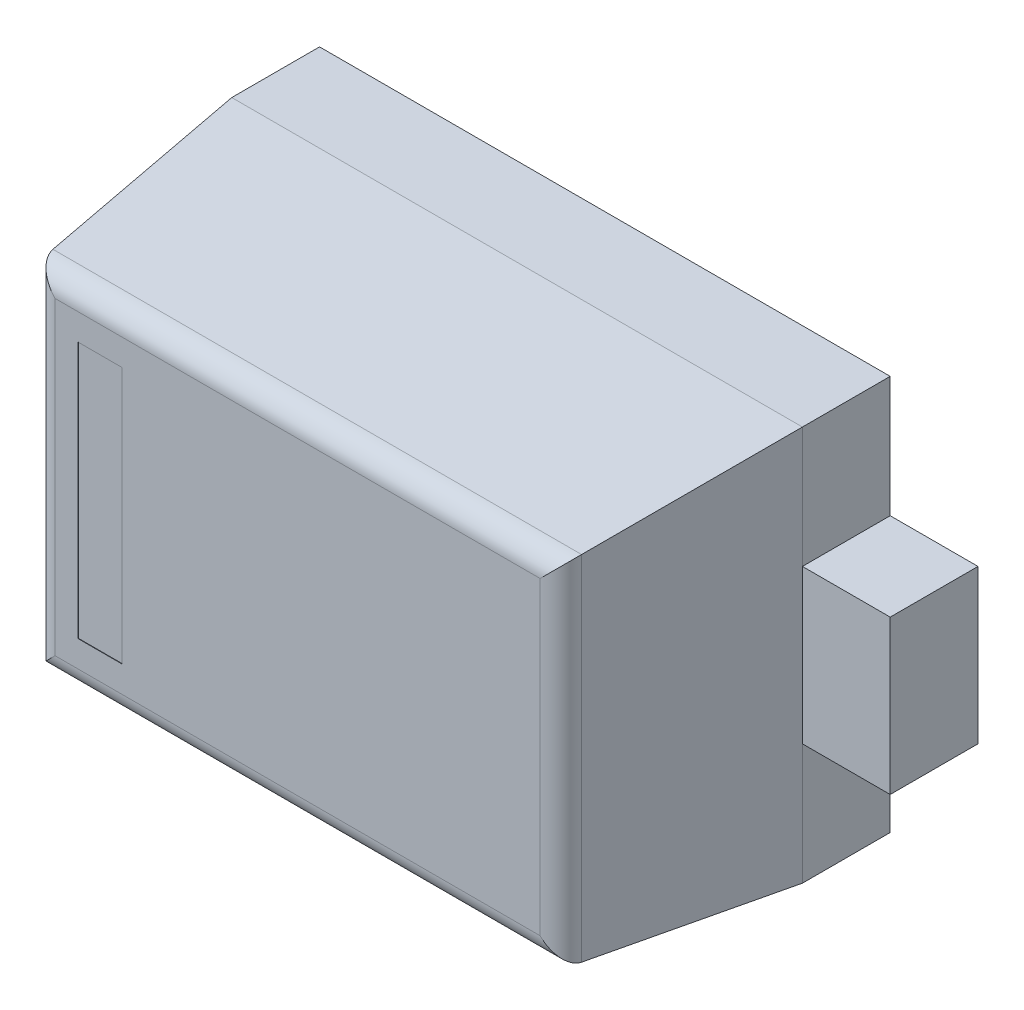
ISO-10303-21;
HEADER;
FILE_DESCRIPTION(('STEP AP214'),'2;1');
FILE_NAME('part.step','',(''),(''),'','','');
FILE_SCHEMA(('AUTOMOTIVE_DESIGN { 1 0 10303 214 1 1 1 1 }'));
ENDSEC;
DATA;
#1=APPLICATION_CONTEXT('core data for automotive mechanical design processes');
#2=APPLICATION_PROTOCOL_DEFINITION('international standard','automotive_design',2000,#1);
#3=PRODUCT_CONTEXT('',#1,'mechanical');
#4=PRODUCT('Part','Part','',(#3));
#5=PRODUCT_RELATED_PRODUCT_CATEGORY('part','',(#4));
#6=PRODUCT_DEFINITION_FORMATION('','',#4);
#7=PRODUCT_DEFINITION_CONTEXT('part definition',#1,'design');
#8=PRODUCT_DEFINITION('design','',#6,#7);
#9=PRODUCT_DEFINITION_SHAPE('','',#8);
#10=(LENGTH_UNIT() NAMED_UNIT(*) SI_UNIT(.MILLI.,.METRE.));
#11=(NAMED_UNIT(*) PLANE_ANGLE_UNIT() SI_UNIT($,.RADIAN.));
#12=(NAMED_UNIT(*) SI_UNIT($,.STERADIAN.) SOLID_ANGLE_UNIT());
#13=UNCERTAINTY_MEASURE_WITH_UNIT(LENGTH_MEASURE(1.E-05),#10,'distance_accuracy_value','');
#14=(GEOMETRIC_REPRESENTATION_CONTEXT(3) GLOBAL_UNCERTAINTY_ASSIGNED_CONTEXT((#13)) GLOBAL_UNIT_ASSIGNED_CONTEXT((#10,
#11,#12)) REPRESENTATION_CONTEXT('',''));
#15=CARTESIAN_POINT('',(0.,0.,0.));
#16=DIRECTION('',(0.,0.,1.));
#17=DIRECTION('',(1.,0.,0.));
#18=AXIS2_PLACEMENT_3D('',#15,#16,#17);
#19=CARTESIAN_POINT('',(0.,0.,0.2));
#20=DIRECTION('',(0.,0.,-1.));
#21=DIRECTION('',(0.,-1.,0.));
#22=AXIS2_PLACEMENT_3D('',#19,#20,#21);
#23=PLANE('',#22);
#24=DIRECTION('',(0.,-1.,0.));
#25=VECTOR('',#24,1.);
#26=CARTESIAN_POINT('',(-0.85,0.175,0.2));
#27=LINE('',#26,#25);
#28=CARTESIAN_POINT('',(-0.85,0.175,0.2));
#29=VERTEX_POINT('',#28);
#30=CARTESIAN_POINT('',(-0.85,-0.175,0.2));
#31=VERTEX_POINT('',#30);
#32=EDGE_CURVE('E253',#29,#31,#27,.T.);
#33=ORIENTED_EDGE('',*,*,#32,.T.);
#34=DIRECTION('',(1.,0.,0.));
#35=VECTOR('',#34,1.);
#36=CARTESIAN_POINT('',(-0.65,-0.175,0.2));
#37=LINE('',#36,#35);
#38=CARTESIAN_POINT('',(-0.65,-0.175,0.2));
#39=VERTEX_POINT('',#38);
#40=EDGE_CURVE('E25',#31,#39,#37,.T.);
#41=ORIENTED_EDGE('',*,*,#40,.T.);
#42=DIRECTION('',(0.,1.,0.));
#43=VECTOR('',#42,1.);
#44=CARTESIAN_POINT('',(-0.65,0.175,0.2));
#45=LINE('',#44,#43);
#46=CARTESIAN_POINT('',(-0.65,0.175,0.2));
#47=VERTEX_POINT('',#46);
#48=EDGE_CURVE('E372',#39,#47,#45,.T.);
#49=ORIENTED_EDGE('',*,*,#48,.T.);
#50=DIRECTION('',(-1.,0.,0.));
#51=VECTOR('',#50,1.);
#52=CARTESIAN_POINT('',(-0.65,0.175,0.2));
#53=LINE('',#52,#51);
#54=EDGE_CURVE('E11',#47,#29,#53,.T.);
#55=ORIENTED_EDGE('',*,*,#54,.T.);
#56=EDGE_LOOP('',(#33,#41,#49,#55));
#57=FACE_BOUND('',#56,.T.);
#58=ADVANCED_FACE('F17',(#57),#23,.F.);
#59=CARTESIAN_POINT('',(-0.65,0.175,0.2));
#60=DIRECTION('',(0.,-1.,0.));
#61=DIRECTION('',(0.,0.,-1.));
#62=AXIS2_PLACEMENT_3D('',#59,#60,#61);
#63=PLANE('',#62);
#64=DIRECTION('',(-1.,0.,0.));
#65=VECTOR('',#64,1.);
#66=CARTESIAN_POINT('',(-0.65,0.175,0.));
#67=LINE('',#66,#65);
#68=CARTESIAN_POINT('',(-0.65,0.175,0.));
#69=VERTEX_POINT('',#68);
#70=CARTESIAN_POINT('',(-0.85,0.175,0.));
#71=VERTEX_POINT('',#70);
#72=EDGE_CURVE('E330',#69,#71,#67,.T.);
#73=ORIENTED_EDGE('',*,*,#72,.T.);
#74=DIRECTION('',(0.,0.,-1.));
#75=VECTOR('',#74,1.);
#76=CARTESIAN_POINT('',(-0.85,0.175,0.2));
#77=LINE('',#76,#75);
#78=EDGE_CURVE('E295',#29,#71,#77,.T.);
#79=ORIENTED_EDGE('',*,*,#78,.F.);
#80=ORIENTED_EDGE('',*,*,#54,.F.);
#81=DIRECTION('',(0.,0.,-1.));
#82=VECTOR('',#81,1.);
#83=CARTESIAN_POINT('',(-0.65,0.175,0.2));
#84=LINE('',#83,#82);
#85=EDGE_CURVE('E457',#47,#69,#84,.T.);
#86=ORIENTED_EDGE('',*,*,#85,.T.);
#87=EDGE_LOOP('',(#73,#79,#80,#86));
#88=FACE_BOUND('',#87,.T.);
#89=ADVANCED_FACE('F455',(#88),#63,.F.);
#90=CARTESIAN_POINT('',(-0.65,-0.175,0.2));
#91=DIRECTION('',(0.,1.,0.));
#92=DIRECTION('',(1.,0.,0.));
#93=AXIS2_PLACEMENT_3D('',#90,#91,#92);
#94=PLANE('',#93);
#95=DIRECTION('',(1.,0.,0.));
#96=VECTOR('',#95,1.);
#97=CARTESIAN_POINT('',(-0.65,-0.175,0.));
#98=LINE('',#97,#96);
#99=CARTESIAN_POINT('',(-0.85,-0.175,0.));
#100=VERTEX_POINT('',#99);
#101=CARTESIAN_POINT('',(-0.65,-0.175,0.));
#102=VERTEX_POINT('',#101);
#103=EDGE_CURVE('E316',#100,#102,#98,.T.);
#104=ORIENTED_EDGE('',*,*,#103,.T.);
#105=DIRECTION('',(0.,0.,-1.));
#106=VECTOR('',#105,1.);
#107=CARTESIAN_POINT('',(-0.65,-0.175,0.2));
#108=LINE('',#107,#106);
#109=EDGE_CURVE('E264',#39,#102,#108,.T.);
#110=ORIENTED_EDGE('',*,*,#109,.F.);
#111=ORIENTED_EDGE('',*,*,#40,.F.);
#112=DIRECTION('',(0.,0.,-1.));
#113=VECTOR('',#112,1.);
#114=CARTESIAN_POINT('',(-0.85,-0.175,0.2));
#115=LINE('',#114,#113);
#116=EDGE_CURVE('E250',#31,#100,#115,.T.);
#117=ORIENTED_EDGE('',*,*,#116,.T.);
#118=EDGE_LOOP('',(#104,#110,#111,#117));
#119=FACE_BOUND('',#118,.T.);
#120=ADVANCED_FACE('F460',(#119),#94,.F.);
#121=CARTESIAN_POINT('',(-0.85,0.175,0.2));
#122=DIRECTION('',(1.,0.,0.));
#123=DIRECTION('',(0.,1.,0.));
#124=AXIS2_PLACEMENT_3D('',#121,#122,#123);
#125=PLANE('',#124);
#126=DIRECTION('',(0.,-1.,0.));
#127=VECTOR('',#126,1.);
#128=CARTESIAN_POINT('',(-0.85,0.175,0.));
#129=LINE('',#128,#127);
#130=EDGE_CURVE('E326',#71,#100,#129,.T.);
#131=ORIENTED_EDGE('',*,*,#130,.T.);
#132=ORIENTED_EDGE('',*,*,#116,.F.);
#133=ORIENTED_EDGE('',*,*,#32,.F.);
#134=ORIENTED_EDGE('',*,*,#78,.T.);
#135=EDGE_LOOP('',(#131,#132,#133,#134));
#136=FACE_BOUND('',#135,.T.);
#137=ADVANCED_FACE('F449',(#136),#125,.F.);
#138=CARTESIAN_POINT('',(0.,0.,0.2));
#139=DIRECTION('',(0.,0.,-1.));
#140=DIRECTION('',(0.,-1.,0.));
#141=AXIS2_PLACEMENT_3D('',#138,#139,#140);
#142=PLANE('',#141);
#143=DIRECTION('',(0.,1.,0.));
#144=VECTOR('',#143,1.);
#145=CARTESIAN_POINT('',(0.85,-0.175,0.2));
#146=LINE('',#145,#144);
#147=CARTESIAN_POINT('',(0.85,-0.175,0.2));
#148=VERTEX_POINT('',#147);
#149=CARTESIAN_POINT('',(0.85,0.175,0.2));
#150=VERTEX_POINT('',#149);
#151=EDGE_CURVE('E436',#148,#150,#146,.T.);
#152=ORIENTED_EDGE('',*,*,#151,.T.);
#153=DIRECTION('',(-1.,0.,0.));
#154=VECTOR('',#153,1.);
#155=CARTESIAN_POINT('',(0.65,0.175,0.2));
#156=LINE('',#155,#154);
#157=CARTESIAN_POINT('',(0.65,0.175,0.2));
#158=VERTEX_POINT('',#157);
#159=EDGE_CURVE('E333',#150,#158,#156,.T.);
#160=ORIENTED_EDGE('',*,*,#159,.T.);
#161=DIRECTION('',(0.,-1.,0.));
#162=VECTOR('',#161,1.);
#163=CARTESIAN_POINT('',(0.65,-0.175,0.2));
#164=LINE('',#163,#162);
#165=CARTESIAN_POINT('',(0.65,-0.175,0.2));
#166=VERTEX_POINT('',#165);
#167=EDGE_CURVE('E355',#158,#166,#164,.T.);
#168=ORIENTED_EDGE('',*,*,#167,.T.);
#169=DIRECTION('',(1.,0.,0.));
#170=VECTOR('',#169,1.);
#171=CARTESIAN_POINT('',(0.65,-0.175,0.2));
#172=LINE('',#171,#170);
#173=EDGE_CURVE('E226',#166,#148,#172,.T.);
#174=ORIENTED_EDGE('',*,*,#173,.T.);
#175=EDGE_LOOP('',(#152,#160,#168,#174));
#176=FACE_BOUND('',#175,.T.);
#177=ADVANCED_FACE('F518',(#176),#142,.F.);
#178=CARTESIAN_POINT('',(0.65,-0.175,0.2));
#179=DIRECTION('',(0.,1.,0.));
#180=DIRECTION('',(1.,0.,0.));
#181=AXIS2_PLACEMENT_3D('',#178,#179,#180);
#182=PLANE('',#181);
#183=DIRECTION('',(1.,0.,0.));
#184=VECTOR('',#183,1.);
#185=CARTESIAN_POINT('',(0.65,-0.175,0.));
#186=LINE('',#185,#184);
#187=CARTESIAN_POINT('',(0.65,-0.175,0.));
#188=VERTEX_POINT('',#187);
#189=CARTESIAN_POINT('',(0.85,-0.175,0.));
#190=VERTEX_POINT('',#189);
#191=EDGE_CURVE('E201',#188,#190,#186,.T.);
#192=ORIENTED_EDGE('',*,*,#191,.T.);
#193=DIRECTION('',(0.,0.,-1.));
#194=VECTOR('',#193,1.);
#195=CARTESIAN_POINT('',(0.85,-0.175,0.2));
#196=LINE('',#195,#194);
#197=EDGE_CURVE('E440',#148,#190,#196,.T.);
#198=ORIENTED_EDGE('',*,*,#197,.F.);
#199=ORIENTED_EDGE('',*,*,#173,.F.);
#200=DIRECTION('',(0.,0.,-1.));
#201=VECTOR('',#200,1.);
#202=CARTESIAN_POINT('',(0.65,-0.175,0.2));
#203=LINE('',#202,#201);
#204=EDGE_CURVE('E219',#166,#188,#203,.T.);
#205=ORIENTED_EDGE('',*,*,#204,.T.);
#206=EDGE_LOOP('',(#192,#198,#199,#205));
#207=FACE_BOUND('',#206,.T.);
#208=ADVANCED_FACE('F225',(#207),#182,.F.);
#209=CARTESIAN_POINT('',(0.65,0.175,0.2));
#210=DIRECTION('',(0.,-1.,0.));
#211=DIRECTION('',(-1.,0.,0.));
#212=AXIS2_PLACEMENT_3D('',#209,#210,#211);
#213=PLANE('',#212);
#214=DIRECTION('',(-1.,0.,0.));
#215=VECTOR('',#214,1.);
#216=CARTESIAN_POINT('',(0.65,0.175,0.));
#217=LINE('',#216,#215);
#218=CARTESIAN_POINT('',(0.85,0.175,0.));
#219=VERTEX_POINT('',#218);
#220=CARTESIAN_POINT('',(0.65,0.175,0.));
#221=VERTEX_POINT('',#220);
#222=EDGE_CURVE('E337',#219,#221,#217,.T.);
#223=ORIENTED_EDGE('',*,*,#222,.T.);
#224=DIRECTION('',(0.,0.,-1.));
#225=VECTOR('',#224,1.);
#226=CARTESIAN_POINT('',(0.65,0.175,0.2));
#227=LINE('',#226,#225);
#228=EDGE_CURVE('E256',#158,#221,#227,.T.);
#229=ORIENTED_EDGE('',*,*,#228,.F.);
#230=ORIENTED_EDGE('',*,*,#159,.F.);
#231=DIRECTION('',(0.,0.,-1.));
#232=VECTOR('',#231,1.);
#233=CARTESIAN_POINT('',(0.85,0.175,0.2));
#234=LINE('',#233,#232);
#235=EDGE_CURVE('E428',#150,#219,#234,.T.);
#236=ORIENTED_EDGE('',*,*,#235,.T.);
#237=EDGE_LOOP('',(#223,#229,#230,#236));
#238=FACE_BOUND('',#237,.T.);
#239=ADVANCED_FACE('F508',(#238),#213,.F.);
#240=CARTESIAN_POINT('',(0.85,-0.175,0.2));
#241=DIRECTION('',(-1.,0.,0.));
#242=DIRECTION('',(0.,0.,1.));
#243=AXIS2_PLACEMENT_3D('',#240,#241,#242);
#244=PLANE('',#243);
#245=DIRECTION('',(0.,1.,0.));
#246=VECTOR('',#245,1.);
#247=CARTESIAN_POINT('',(0.85,-0.175,0.));
#248=LINE('',#247,#246);
#249=EDGE_CURVE('E208',#190,#219,#248,.T.);
#250=ORIENTED_EDGE('',*,*,#249,.T.);
#251=ORIENTED_EDGE('',*,*,#235,.F.);
#252=ORIENTED_EDGE('',*,*,#151,.F.);
#253=ORIENTED_EDGE('',*,*,#197,.T.);
#254=EDGE_LOOP('',(#250,#251,#252,#253));
#255=FACE_BOUND('',#254,.T.);
#256=ADVANCED_FACE('F511',(#255),#244,.F.);
#257=CARTESIAN_POINT('',(0.,0.,0.699));
#258=DIRECTION('',(0.,0.,1.));
#259=DIRECTION('',(1.,0.,0.));
#260=AXIS2_PLACEMENT_3D('',#257,#258,#259);
#261=PLANE('',#260);
#262=DIRECTION('',(0.,1.,0.));
#263=VECTOR('',#262,1.);
#264=CARTESIAN_POINT('',(-0.4,0.2925,0.699));
#265=LINE('',#264,#263);
#266=CARTESIAN_POINT('',(-0.4,-0.2925,0.699));
#267=VERTEX_POINT('',#266);
#268=CARTESIAN_POINT('',(-0.4,0.2925,0.699));
#269=VERTEX_POINT('',#268);
#270=EDGE_CURVE('E386',#267,#269,#265,.T.);
#271=ORIENTED_EDGE('',*,*,#270,.T.);
#272=DIRECTION('',(-1.,0.,0.));
#273=VECTOR('',#272,1.);
#274=CARTESIAN_POINT('',(-0.5,0.2925,0.699));
#275=LINE('',#274,#273);
#276=CARTESIAN_POINT('',(-0.5,0.2925,0.699));
#277=VERTEX_POINT('',#276);
#278=EDGE_CURVE('E425',#269,#277,#275,.T.);
#279=ORIENTED_EDGE('',*,*,#278,.T.);
#280=DIRECTION('',(0.,-1.,0.));
#281=VECTOR('',#280,1.);
#282=CARTESIAN_POINT('',(-0.5,0.2925,0.699));
#283=LINE('',#282,#281);
#284=CARTESIAN_POINT('',(-0.5,-0.2925,0.699));
#285=VERTEX_POINT('',#284);
#286=EDGE_CURVE('E424',#277,#285,#283,.T.);
#287=ORIENTED_EDGE('',*,*,#286,.T.);
#288=DIRECTION('',(1.,0.,0.));
#289=VECTOR('',#288,1.);
#290=CARTESIAN_POINT('',(-0.5,-0.2925,0.699));
#291=LINE('',#290,#289);
#292=EDGE_CURVE('E385',#285,#267,#291,.T.);
#293=ORIENTED_EDGE('',*,*,#292,.T.);
#294=EDGE_LOOP('',(#271,#279,#287,#293));
#295=FACE_BOUND('',#294,.T.);
#296=ADVANCED_FACE('F506',(#295),#261,.T.);
#297=CARTESIAN_POINT('',(-0.5,0.2925,0.699));
#298=DIRECTION('',(0.,1.,0.));
#299=DIRECTION('',(1.,0.,0.));
#300=AXIS2_PLACEMENT_3D('',#297,#298,#299);
#301=PLANE('',#300);
#302=DIRECTION('',(-1.,0.,0.));
#303=VECTOR('',#302,1.);
#304=CARTESIAN_POINT('',(-0.5,0.2925,0.7));
#305=LINE('',#304,#303);
#306=CARTESIAN_POINT('',(-0.4,0.2925,0.7));
#307=VERTEX_POINT('',#306);
#308=CARTESIAN_POINT('',(-0.5,0.2925,0.7));
#309=VERTEX_POINT('',#308);
#310=EDGE_CURVE('E312',#307,#309,#305,.T.);
#311=ORIENTED_EDGE('',*,*,#310,.T.);
#312=DIRECTION('',(0.,0.,1.));
#313=VECTOR('',#312,1.);
#314=CARTESIAN_POINT('',(-0.5,0.2925,0.699));
#315=LINE('',#314,#313);
#316=EDGE_CURVE('E429',#277,#309,#315,.T.);
#317=ORIENTED_EDGE('',*,*,#316,.F.);
#318=ORIENTED_EDGE('',*,*,#278,.F.);
#319=DIRECTION('',(0.,0.,1.));
#320=VECTOR('',#319,1.);
#321=CARTESIAN_POINT('',(-0.4,0.2925,0.699));
#322=LINE('',#321,#320);
#323=EDGE_CURVE('E410',#269,#307,#322,.T.);
#324=ORIENTED_EDGE('',*,*,#323,.T.);
#325=EDGE_LOOP('',(#311,#317,#318,#324));
#326=FACE_BOUND('',#325,.T.);
#327=ADVANCED_FACE('F502',(#326),#301,.F.);
#328=CARTESIAN_POINT('',(-0.5,0.2925,0.699));
#329=DIRECTION('',(-1.,0.,0.));
#330=DIRECTION('',(0.,1.,0.));
#331=AXIS2_PLACEMENT_3D('',#328,#329,#330);
#332=PLANE('',#331);
#333=DIRECTION('',(0.,-1.,0.));
#334=VECTOR('',#333,1.);
#335=CARTESIAN_POINT('',(-0.5,0.2925,0.7));
#336=LINE('',#335,#334);
#337=CARTESIAN_POINT('',(-0.5,-0.2925,0.7));
#338=VERTEX_POINT('',#337);
#339=EDGE_CURVE('E317',#309,#338,#336,.T.);
#340=ORIENTED_EDGE('',*,*,#339,.T.);
#341=DIRECTION('',(0.,0.,1.));
#342=VECTOR('',#341,1.);
#343=CARTESIAN_POINT('',(-0.5,-0.2925,0.699));
#344=LINE('',#343,#342);
#345=EDGE_CURVE('E421',#285,#338,#344,.T.);
#346=ORIENTED_EDGE('',*,*,#345,.F.);
#347=ORIENTED_EDGE('',*,*,#286,.F.);
#348=ORIENTED_EDGE('',*,*,#316,.T.);
#349=EDGE_LOOP('',(#340,#346,#347,#348));
#350=FACE_BOUND('',#349,.T.);
#351=ADVANCED_FACE('F498',(#350),#332,.F.);
#352=CARTESIAN_POINT('',(-0.5,-0.2925,0.699));
#353=DIRECTION('',(0.,-1.,0.));
#354=DIRECTION('',(-1.,0.,0.));
#355=AXIS2_PLACEMENT_3D('',#352,#353,#354);
#356=PLANE('',#355);
#357=DIRECTION('',(1.,0.,0.));
#358=VECTOR('',#357,1.);
#359=CARTESIAN_POINT('',(-0.5,-0.2925,0.7));
#360=LINE('',#359,#358);
#361=CARTESIAN_POINT('',(-0.4,-0.2925,0.7));
#362=VERTEX_POINT('',#361);
#363=EDGE_CURVE('E311',#338,#362,#360,.T.);
#364=ORIENTED_EDGE('',*,*,#363,.T.);
#365=DIRECTION('',(0.,0.,1.));
#366=VECTOR('',#365,1.);
#367=CARTESIAN_POINT('',(-0.4,-0.2925,0.699));
#368=LINE('',#367,#366);
#369=EDGE_CURVE('E382',#267,#362,#368,.T.);
#370=ORIENTED_EDGE('',*,*,#369,.F.);
#371=ORIENTED_EDGE('',*,*,#292,.F.);
#372=ORIENTED_EDGE('',*,*,#345,.T.);
#373=EDGE_LOOP('',(#364,#370,#371,#372));
#374=FACE_BOUND('',#373,.T.);
#375=ADVANCED_FACE('F494',(#374),#356,.F.);
#376=CARTESIAN_POINT('',(-0.4,0.2925,0.699));
#377=DIRECTION('',(1.,0.,0.));
#378=DIRECTION('',(0.,1.,0.));
#379=AXIS2_PLACEMENT_3D('',#376,#377,#378);
#380=PLANE('',#379);
#381=DIRECTION('',(0.,1.,0.));
#382=VECTOR('',#381,1.);
#383=CARTESIAN_POINT('',(-0.4,0.2925,0.7));
#384=LINE('',#383,#382);
#385=EDGE_CURVE('E307',#362,#307,#384,.T.);
#386=ORIENTED_EDGE('',*,*,#385,.T.);
#387=ORIENTED_EDGE('',*,*,#323,.F.);
#388=ORIENTED_EDGE('',*,*,#270,.F.);
#389=ORIENTED_EDGE('',*,*,#369,.T.);
#390=EDGE_LOOP('',(#386,#387,#388,#389));
#391=FACE_BOUND('',#390,.T.);
#392=ADVANCED_FACE('F490',(#391),#380,.F.);
#393=CARTESIAN_POINT('',(0.,0.352427680152268,0.65));
#394=DIRECTION('',(-1.,0.,0.));
#395=DIRECTION('',(0.,-1.,0.));
#396=AXIS2_PLACEMENT_3D('',#393,#394,#395);
#397=CYLINDRICAL_SURFACE('',#396,0.05);
#398=CARTESIAN_POINT('',(0.55242768015227,0.352427680152268,0.7));
#399=CARTESIAN_POINT('',(0.579340498057533,0.379340498057531,0.7));
#400=CARTESIAN_POINT('',(0.599340619422844,0.399340619422842,0.681991809836226));
#401=CARTESIAN_POINT('',(0.602153774920683,0.402153774920681,0.655226423163382));
#402=(BOUNDED_CURVE() B_SPLINE_CURVE(3,(#398,#399,#400,#401),.UNSPECIFIED.,.F.,
.F.) B_SPLINE_CURVE_WITH_KNOTS((4,4),(4.71238898038469,6.17846555205993),
.UNSPECIFIED.) CURVE() GEOMETRIC_REPRESENTATION_ITEM() RATIONAL_B_SPLINE_CURVE((1.,
0.828763216984929,0.828763216984929,1.)) REPRESENTATION_ITEM(''));
#403=CARTESIAN_POINT('',(0.55242768015227,0.352427680152268,0.7));
#404=VERTEX_POINT('',#403);
#405=CARTESIAN_POINT('',(0.602153774920683,0.402153774920681,0.655226423163382));
#406=VERTEX_POINT('',#405);
#407=EDGE_CURVE('E394',#404,#406,#402,.T.);
#408=ORIENTED_EDGE('',*,*,#407,.T.);
#409=DIRECTION('',(1.,0.,0.));
#410=VECTOR('',#409,1.);
#411=CARTESIAN_POINT('',(0.,0.402153774920682,0.655226423163382));
#412=LINE('',#411,#410);
#413=CARTESIAN_POINT('',(-0.602153774920683,0.402153774920682,0.655226423163382));
#414=VERTEX_POINT('',#413);
#415=EDGE_CURVE('E285',#414,#406,#412,.T.);
#416=ORIENTED_EDGE('',*,*,#415,.F.);
#417=CARTESIAN_POINT('',(-0.602153774920683,0.402153774920682,0.655226423163382));
#418=CARTESIAN_POINT('',(-0.599340619422844,0.399340619422843,0.681991809836226));
#419=CARTESIAN_POINT('',(-0.579340498057532,0.379340498057531,0.7));
#420=CARTESIAN_POINT('',(-0.552427680152269,0.352427680152268,0.7));
#421=(BOUNDED_CURVE() B_SPLINE_CURVE(3,(#417,#418,#419,#420),.UNSPECIFIED.,.F.,
.F.) B_SPLINE_CURVE_WITH_KNOTS((4,4),(3.24631240870945,4.71238898038469),
.UNSPECIFIED.) CURVE() GEOMETRIC_REPRESENTATION_ITEM() RATIONAL_B_SPLINE_CURVE((1.,
0.828763216984929,0.828763216984929,1.)) REPRESENTATION_ITEM(''));
#422=CARTESIAN_POINT('',(-0.552427680152269,0.352427680152268,0.7));
#423=VERTEX_POINT('',#422);
#424=EDGE_CURVE('E402',#414,#423,#421,.T.);
#425=ORIENTED_EDGE('',*,*,#424,.T.);
#426=DIRECTION('',(-1.,0.,0.));
#427=VECTOR('',#426,1.);
#428=CARTESIAN_POINT('',(0.,0.352427680152268,0.7));
#429=LINE('',#428,#427);
#430=EDGE_CURVE('E292',#404,#423,#429,.T.);
#431=ORIENTED_EDGE('',*,*,#430,.F.);
#432=EDGE_LOOP('',(#408,#416,#425,#431));
#433=FACE_BOUND('',#432,.T.);
#434=ADVANCED_FACE('F493',(#433),#397,.T.);
#435=CARTESIAN_POINT('',(-0.552427680152269,0.,0.65));
#436=DIRECTION('',(0.,-1.,0.));
#437=DIRECTION('',(0.,0.,-1.));
#438=AXIS2_PLACEMENT_3D('',#435,#436,#437);
#439=CYLINDRICAL_SURFACE('',#438,0.05);
#440=CARTESIAN_POINT('',(-0.602153774920683,-0.402153774920684,0.655226423163383));
#441=CARTESIAN_POINT('',(-0.599340619422842,-0.399340619422845,0.681991809836226));
#442=CARTESIAN_POINT('',(-0.579340498057532,-0.379340498057534,0.7));
#443=CARTESIAN_POINT('',(-0.552427680152269,-0.352427680152271,0.7));
#444=(BOUNDED_CURVE() B_SPLINE_CURVE(3,(#440,#441,#442,#443),.UNSPECIFIED.,.F.,
.F.) B_SPLINE_CURVE_WITH_KNOTS((4,4),(0.104719755119658,1.5707963267949),
.UNSPECIFIED.) CURVE() GEOMETRIC_REPRESENTATION_ITEM() RATIONAL_B_SPLINE_CURVE((1.,
0.828763216984929,0.828763216984929,1.)) REPRESENTATION_ITEM(''));
#445=CARTESIAN_POINT('',(-0.602153774920683,-0.402153774920684,0.655226423163383));
#446=VERTEX_POINT('',#445);
#447=CARTESIAN_POINT('',(-0.552427680152269,-0.352427680152271,0.7));
#448=VERTEX_POINT('',#447);
#449=EDGE_CURVE('E342',#446,#448,#444,.T.);
#450=ORIENTED_EDGE('',*,*,#449,.T.);
#451=DIRECTION('',(0.,-1.,0.));
#452=VECTOR('',#451,1.);
#453=CARTESIAN_POINT('',(-0.552427680152269,0.,0.7));
#454=LINE('',#453,#452);
#455=EDGE_CURVE('E299',#423,#448,#454,.T.);
#456=ORIENTED_EDGE('',*,*,#455,.F.);
#457=ORIENTED_EDGE('',*,*,#424,.F.);
#458=DIRECTION('',(0.,1.,0.));
#459=VECTOR('',#458,1.);
#460=CARTESIAN_POINT('',(-0.602153774920683,0.,0.655226423163382));
#461=LINE('',#460,#459);
#462=EDGE_CURVE('E368',#446,#414,#461,.T.);
#463=ORIENTED_EDGE('',*,*,#462,.F.);
#464=EDGE_LOOP('',(#450,#456,#457,#463));
#465=FACE_BOUND('',#464,.T.);
#466=ADVANCED_FACE('F925',(#465),#439,.T.);
#467=CARTESIAN_POINT('',(0.55242768015227,0.,0.65));
#468=DIRECTION('',(0.,1.,0.));
#469=DIRECTION('',(-1.,0.,0.));
#470=AXIS2_PLACEMENT_3D('',#467,#468,#469);
#471=CYLINDRICAL_SURFACE('',#470,0.05);
#472=CARTESIAN_POINT('',(0.55242768015227,-0.352427680152271,0.7));
#473=CARTESIAN_POINT('',(0.579340498057533,-0.379340498057534,0.7));
#474=CARTESIAN_POINT('',(0.599340619422844,-0.399340619422845,0.681991809836226));
#475=CARTESIAN_POINT('',(0.602153774920684,-0.402153774920684,0.655226423163383));
#476=(BOUNDED_CURVE() B_SPLINE_CURVE(3,(#472,#473,#474,#475),.UNSPECIFIED.,.F.,
.F.) B_SPLINE_CURVE_WITH_KNOTS((4,4),(4.71238898038469,6.17846555205993),
.UNSPECIFIED.) CURVE() GEOMETRIC_REPRESENTATION_ITEM() RATIONAL_B_SPLINE_CURVE((1.,
0.828763216984929,0.828763216984929,1.)) REPRESENTATION_ITEM(''));
#477=CARTESIAN_POINT('',(0.55242768015227,-0.352427680152271,0.7));
#478=VERTEX_POINT('',#477);
#479=CARTESIAN_POINT('',(0.602153774920684,-0.402153774920684,0.655226423163383));
#480=VERTEX_POINT('',#479);
#481=EDGE_CURVE('E347',#478,#480,#476,.T.);
#482=ORIENTED_EDGE('',*,*,#481,.T.);
#483=DIRECTION('',(0.,-1.,0.));
#484=VECTOR('',#483,1.);
#485=CARTESIAN_POINT('',(0.602153774920683,0.,0.655226423163382));
#486=LINE('',#485,#484);
#487=EDGE_CURVE('E356',#406,#480,#486,.T.);
#488=ORIENTED_EDGE('',*,*,#487,.F.);
#489=ORIENTED_EDGE('',*,*,#407,.F.);
#490=DIRECTION('',(0.,1.,0.));
#491=VECTOR('',#490,1.);
#492=CARTESIAN_POINT('',(0.55242768015227,0.,0.7));
#493=LINE('',#492,#491);
#494=EDGE_CURVE('E288',#478,#404,#493,.T.);
#495=ORIENTED_EDGE('',*,*,#494,.F.);
#496=EDGE_LOOP('',(#482,#488,#489,#495));
#497=FACE_BOUND('',#496,.T.);
#498=ADVANCED_FACE('F566',(#497),#471,.T.);
#499=CARTESIAN_POINT('',(0.,-0.352427680152271,0.65));
#500=DIRECTION('',(1.,0.,0.));
#501=DIRECTION('',(0.,0.,-1.));
#502=AXIS2_PLACEMENT_3D('',#499,#500,#501);
#503=CYLINDRICAL_SURFACE('',#502,0.05);
#504=ORIENTED_EDGE('',*,*,#449,.F.);
#505=DIRECTION('',(-1.,0.,0.));
#506=VECTOR('',#505,1.);
#507=CARTESIAN_POINT('',(0.,-0.402153774920684,0.655226423163382));
#508=LINE('',#507,#506);
#509=EDGE_CURVE('E348',#480,#446,#508,.T.);
#510=ORIENTED_EDGE('',*,*,#509,.F.);
#511=ORIENTED_EDGE('',*,*,#481,.F.);
#512=DIRECTION('',(1.,0.,0.));
#513=VECTOR('',#512,1.);
#514=CARTESIAN_POINT('',(0.,-0.352427680152271,0.7));
#515=LINE('',#514,#513);
#516=EDGE_CURVE('E303',#448,#478,#515,.T.);
#517=ORIENTED_EDGE('',*,*,#516,.F.);
#518=EDGE_LOOP('',(#504,#510,#511,#517));
#519=FACE_BOUND('',#518,.T.);
#520=ADVANCED_FACE('F572',(#519),#503,.T.);
#521=CARTESIAN_POINT('',(0.,-0.397447882367163,0.7));
#522=DIRECTION('',(0.,-0.994521895368274,0.10452846326765));
#523=DIRECTION('',(-1.,0.,0.));
#524=AXIS2_PLACEMENT_3D('',#521,#522,#523);
#525=PLANE('',#524);
#526=DIRECTION('',(-0.103962051184495,0.103962051184495,0.989132844377854));
#527=VECTOR('',#526,1.);
#528=CARTESIAN_POINT('',(0.593152222695792,-0.393152222695793,0.74087047168472));
#529=LINE('',#528,#527);
#530=CARTESIAN_POINT('',(0.65,-0.45,0.199999999999984));
#531=VERTEX_POINT('',#530);
#532=EDGE_CURVE('E349',#531,#480,#529,.T.);
#533=ORIENTED_EDGE('',*,*,#532,.T.);
#534=ORIENTED_EDGE('',*,*,#509,.T.);
#535=DIRECTION('',(-0.103962051184495,-0.103962051184495,-0.989132844377854));
#536=VECTOR('',#535,1.);
#537=CARTESIAN_POINT('',(-0.593152222695791,-0.393152222695793,0.74087047168472));
#538=LINE('',#537,#536);
#539=CARTESIAN_POINT('',(-0.65,-0.45,0.199999999999984));
#540=VERTEX_POINT('',#539);
#541=EDGE_CURVE('E365',#446,#540,#538,.T.);
#542=ORIENTED_EDGE('',*,*,#541,.T.);
#543=DIRECTION('',(-1.,0.,0.));
#544=VECTOR('',#543,1.);
#545=CARTESIAN_POINT('',(-0.65,-0.45,0.199999999999983));
#546=LINE('',#545,#544);
#547=EDGE_CURVE('E278',#531,#540,#546,.T.);
#548=ORIENTED_EDGE('',*,*,#547,.F.);
#549=EDGE_LOOP('',(#533,#534,#542,#548));
#550=FACE_BOUND('',#549,.T.);
#551=ADVANCED_FACE('F484',(#550),#525,.T.);
#552=CARTESIAN_POINT('',(0.597447882367162,0.,0.7));
#553=DIRECTION('',(0.994521895368274,0.,0.10452846326765));
#554=DIRECTION('',(0.,-1.,0.));
#555=AXIS2_PLACEMENT_3D('',#552,#553,#554);
#556=PLANE('',#555);
#557=DIRECTION('',(-0.103962051184495,-0.103962051184495,0.989132844377854));
#558=VECTOR('',#557,1.);
#559=CARTESIAN_POINT('',(0.593152222695792,0.39315222269579,0.74087047168472));
#560=LINE('',#559,#558);
#561=CARTESIAN_POINT('',(0.65,0.45,0.199999999999984));
#562=VERTEX_POINT('',#561);
#563=EDGE_CURVE('E361',#562,#406,#560,.T.);
#564=ORIENTED_EDGE('',*,*,#563,.T.);
#565=ORIENTED_EDGE('',*,*,#487,.T.);
#566=ORIENTED_EDGE('',*,*,#532,.F.);
#567=DIRECTION('',(0.,-1.,0.));
#568=VECTOR('',#567,1.);
#569=CARTESIAN_POINT('',(0.65,-0.45,0.199999999999983));
#570=LINE('',#569,#568);
#571=EDGE_CURVE('E229',#166,#531,#570,.T.);
#572=ORIENTED_EDGE('',*,*,#571,.F.);
#573=ORIENTED_EDGE('',*,*,#167,.F.);
#574=DIRECTION('',(0.,-1.,0.));
#575=VECTOR('',#574,1.);
#576=CARTESIAN_POINT('',(0.65,-0.45,0.199999999999983));
#577=LINE('',#576,#575);
#578=EDGE_CURVE('E223',#562,#158,#577,.T.);
#579=ORIENTED_EDGE('',*,*,#578,.F.);
#580=EDGE_LOOP('',(#564,#565,#566,#572,#573,#579));
#581=FACE_BOUND('',#580,.T.);
#582=ADVANCED_FACE('F486',(#581),#556,.T.);
#583=CARTESIAN_POINT('',(-0.597447882367161,0.,0.7));
#584=DIRECTION('',(-0.994521895368274,0.,0.10452846326765));
#585=DIRECTION('',(0.,1.,0.));
#586=AXIS2_PLACEMENT_3D('',#583,#584,#585);
#587=PLANE('',#586);
#588=ORIENTED_EDGE('',*,*,#541,.F.);
#589=ORIENTED_EDGE('',*,*,#462,.T.);
#590=DIRECTION('',(-0.103962051184495,0.103962051184495,-0.989132844377854));
#591=VECTOR('',#590,1.);
#592=CARTESIAN_POINT('',(-0.590990601078494,0.390990601078493,0.761436927563815));
#593=LINE('',#592,#591);
#594=CARTESIAN_POINT('',(-0.65,0.45,0.199999999999984));
#595=VERTEX_POINT('',#594);
#596=EDGE_CURVE('E213',#414,#595,#593,.T.);
#597=ORIENTED_EDGE('',*,*,#596,.T.);
#598=DIRECTION('',(0.,1.,0.));
#599=VECTOR('',#598,1.);
#600=CARTESIAN_POINT('',(-0.65,0.45,0.199999999999983));
#601=LINE('',#600,#599);
#602=EDGE_CURVE('E472',#47,#595,#601,.T.);
#603=ORIENTED_EDGE('',*,*,#602,.F.);
#604=ORIENTED_EDGE('',*,*,#48,.F.);
#605=DIRECTION('',(0.,1.,0.));
#606=VECTOR('',#605,1.);
#607=CARTESIAN_POINT('',(-0.65,0.45,0.199999999999983));
#608=LINE('',#607,#606);
#609=EDGE_CURVE('E269',#540,#39,#608,.T.);
#610=ORIENTED_EDGE('',*,*,#609,.F.);
#611=EDGE_LOOP('',(#588,#589,#597,#603,#604,#610));
#612=FACE_BOUND('',#611,.T.);
#613=ADVANCED_FACE('F469',(#612),#587,.T.);
#614=CARTESIAN_POINT('',(0.,0.39744788236716,0.7));
#615=DIRECTION('',(0.,0.994521895368274,0.10452846326765));
#616=DIRECTION('',(1.,0.,0.));
#617=AXIS2_PLACEMENT_3D('',#614,#615,#616);
#618=PLANE('',#617);
#619=ORIENTED_EDGE('',*,*,#596,.F.);
#620=ORIENTED_EDGE('',*,*,#415,.T.);
#621=ORIENTED_EDGE('',*,*,#563,.F.);
#622=DIRECTION('',(1.,0.,0.));
#623=VECTOR('',#622,1.);
#624=CARTESIAN_POINT('',(0.65,0.45,0.199999999999983));
#625=LINE('',#624,#623);
#626=EDGE_CURVE('E244',#595,#562,#625,.T.);
#627=ORIENTED_EDGE('',*,*,#626,.F.);
#628=EDGE_LOOP('',(#619,#620,#621,#627));
#629=FACE_BOUND('',#628,.T.);
#630=ADVANCED_FACE('F560',(#629),#618,.T.);
#631=CARTESIAN_POINT('',(0.,0.,0.));
#632=DIRECTION('',(0.,0.,1.));
#633=DIRECTION('',(1.,0.,0.));
#634=AXIS2_PLACEMENT_3D('',#631,#632,#633);
#635=PLANE('',#634);
#636=DIRECTION('',(0.,1.,0.));
#637=VECTOR('',#636,1.);
#638=CARTESIAN_POINT('',(0.65,0.45,0.));
#639=LINE('',#638,#637);
#640=CARTESIAN_POINT('',(0.65,-0.45,0.));
#641=VERTEX_POINT('',#640);
#642=EDGE_CURVE('E204',#641,#188,#639,.T.);
#643=ORIENTED_EDGE('',*,*,#642,.F.);
#644=DIRECTION('',(1.,0.,0.));
#645=VECTOR('',#644,1.);
#646=CARTESIAN_POINT('',(-0.65,-0.45,0.));
#647=LINE('',#646,#645);
#648=CARTESIAN_POINT('',(-0.65,-0.45,0.));
#649=VERTEX_POINT('',#648);
#650=EDGE_CURVE('E282',#649,#641,#647,.T.);
#651=ORIENTED_EDGE('',*,*,#650,.F.);
#652=DIRECTION('',(0.,-1.,0.));
#653=VECTOR('',#652,1.);
#654=CARTESIAN_POINT('',(-0.65,0.45,0.));
#655=LINE('',#654,#653);
#656=EDGE_CURVE('E268',#102,#649,#655,.T.);
#657=ORIENTED_EDGE('',*,*,#656,.F.);
#658=ORIENTED_EDGE('',*,*,#103,.F.);
#659=ORIENTED_EDGE('',*,*,#130,.F.);
#660=ORIENTED_EDGE('',*,*,#72,.F.);
#661=DIRECTION('',(0.,-1.,0.));
#662=VECTOR('',#661,1.);
#663=CARTESIAN_POINT('',(-0.65,0.45,0.));
#664=LINE('',#663,#662);
#665=CARTESIAN_POINT('',(-0.65,0.45,0.));
#666=VERTEX_POINT('',#665);
#667=EDGE_CURVE('E230',#666,#69,#664,.T.);
#668=ORIENTED_EDGE('',*,*,#667,.F.);
#669=DIRECTION('',(-1.,0.,0.));
#670=VECTOR('',#669,1.);
#671=CARTESIAN_POINT('',(-0.65,0.45,0.));
#672=LINE('',#671,#670);
#673=CARTESIAN_POINT('',(0.65,0.45,0.));
#674=VERTEX_POINT('',#673);
#675=EDGE_CURVE('E247',#674,#666,#672,.T.);
#676=ORIENTED_EDGE('',*,*,#675,.F.);
#677=DIRECTION('',(0.,1.,0.));
#678=VECTOR('',#677,1.);
#679=CARTESIAN_POINT('',(0.65,0.45,0.));
#680=LINE('',#679,#678);
#681=EDGE_CURVE('E260',#221,#674,#680,.T.);
#682=ORIENTED_EDGE('',*,*,#681,.F.);
#683=ORIENTED_EDGE('',*,*,#222,.F.);
#684=ORIENTED_EDGE('',*,*,#249,.F.);
#685=ORIENTED_EDGE('',*,*,#191,.F.);
#686=EDGE_LOOP('',(#643,#651,#657,#658,#659,#660,#668,#676,#682,#683,#684,#685));
#687=FACE_BOUND('',#686,.T.);
#688=ADVANCED_FACE('F203',(#687),#635,.F.);
#689=CARTESIAN_POINT('',(0.,0.,0.7));
#690=DIRECTION('',(0.,0.,1.));
#691=DIRECTION('',(1.,0.,0.));
#692=AXIS2_PLACEMENT_3D('',#689,#690,#691);
#693=PLANE('',#692);
#694=ORIENTED_EDGE('',*,*,#385,.F.);
#695=ORIENTED_EDGE('',*,*,#363,.F.);
#696=ORIENTED_EDGE('',*,*,#339,.F.);
#697=ORIENTED_EDGE('',*,*,#310,.F.);
#698=EDGE_LOOP('',(#694,#695,#696,#697));
#699=FACE_BOUND('',#698,.T.);
#700=ORIENTED_EDGE('',*,*,#494,.T.);
#701=ORIENTED_EDGE('',*,*,#430,.T.);
#702=ORIENTED_EDGE('',*,*,#455,.T.);
#703=ORIENTED_EDGE('',*,*,#516,.T.);
#704=EDGE_LOOP('',(#700,#701,#702,#703));
#705=FACE_BOUND('',#704,.T.);
#706=ADVANCED_FACE('F980',(#699,#705),#693,.T.);
#707=CARTESIAN_POINT('',(-0.65,-0.45,0.7));
#708=DIRECTION('',(0.,1.,0.));
#709=DIRECTION('',(1.,0.,0.));
#710=AXIS2_PLACEMENT_3D('',#707,#708,#709);
#711=PLANE('',#710);
#712=DIRECTION('',(0.,0.,-1.));
#713=VECTOR('',#712,1.);
#714=CARTESIAN_POINT('',(0.65,-0.45,0.7));
#715=LINE('',#714,#713);
#716=EDGE_CURVE('E221',#531,#641,#715,.T.);
#717=ORIENTED_EDGE('',*,*,#716,.F.);
#718=ORIENTED_EDGE('',*,*,#547,.T.);
#719=DIRECTION('',(0.,0.,-1.));
#720=VECTOR('',#719,1.);
#721=CARTESIAN_POINT('',(-0.65,-0.45,0.7));
#722=LINE('',#721,#720);
#723=EDGE_CURVE('E243',#540,#649,#722,.T.);
#724=ORIENTED_EDGE('',*,*,#723,.T.);
#725=ORIENTED_EDGE('',*,*,#650,.T.);
#726=EDGE_LOOP('',(#717,#718,#724,#725));
#727=FACE_BOUND('',#726,.T.);
#728=ADVANCED_FACE('F576',(#727),#711,.F.);
#729=CARTESIAN_POINT('',(-0.65,0.45,0.7));
#730=DIRECTION('',(1.,0.,0.));
#731=DIRECTION('',(0.,1.,0.));
#732=AXIS2_PLACEMENT_3D('',#729,#730,#731);
#733=PLANE('',#732);
#734=ORIENTED_EDGE('',*,*,#609,.T.);
#735=ORIENTED_EDGE('',*,*,#109,.T.);
#736=ORIENTED_EDGE('',*,*,#656,.T.);
#737=ORIENTED_EDGE('',*,*,#723,.F.);
#738=EDGE_LOOP('',(#734,#735,#736,#737));
#739=FACE_BOUND('',#738,.T.);
#740=ADVANCED_FACE('F464',(#739),#733,.F.);
#741=CARTESIAN_POINT('',(-0.65,0.45,0.7));
#742=DIRECTION('',(0.,-1.,0.));
#743=DIRECTION('',(-1.,0.,0.));
#744=AXIS2_PLACEMENT_3D('',#741,#742,#743);
#745=PLANE('',#744);
#746=DIRECTION('',(0.,0.,-1.));
#747=VECTOR('',#746,1.);
#748=CARTESIAN_POINT('',(-0.65,0.45,0.7));
#749=LINE('',#748,#747);
#750=EDGE_CURVE('E239',#595,#666,#749,.T.);
#751=ORIENTED_EDGE('',*,*,#750,.F.);
#752=ORIENTED_EDGE('',*,*,#626,.T.);
#753=DIRECTION('',(0.,0.,-1.));
#754=VECTOR('',#753,1.);
#755=CARTESIAN_POINT('',(0.65,0.45,0.7));
#756=LINE('',#755,#754);
#757=EDGE_CURVE('E248',#562,#674,#756,.T.);
#758=ORIENTED_EDGE('',*,*,#757,.T.);
#759=ORIENTED_EDGE('',*,*,#675,.T.);
#760=EDGE_LOOP('',(#751,#752,#758,#759));
#761=FACE_BOUND('',#760,.T.);
#762=ADVANCED_FACE('F556',(#761),#745,.F.);
#763=CARTESIAN_POINT('',(0.65,0.45,0.7));
#764=DIRECTION('',(-1.,0.,0.));
#765=DIRECTION('',(0.,1.,0.));
#766=AXIS2_PLACEMENT_3D('',#763,#764,#765);
#767=PLANE('',#766);
#768=ORIENTED_EDGE('',*,*,#578,.T.);
#769=ORIENTED_EDGE('',*,*,#228,.T.);
#770=ORIENTED_EDGE('',*,*,#681,.T.);
#771=ORIENTED_EDGE('',*,*,#757,.F.);
#772=EDGE_LOOP('',(#768,#769,#770,#771));
#773=FACE_BOUND('',#772,.T.);
#774=ADVANCED_FACE('F536',(#773),#767,.F.);
#775=CARTESIAN_POINT('',(0.65,0.45,0.7));
#776=DIRECTION('',(-1.,0.,0.));
#777=DIRECTION('',(0.,1.,0.));
#778=AXIS2_PLACEMENT_3D('',#775,#776,#777);
#779=PLANE('',#778);
#780=ORIENTED_EDGE('',*,*,#204,.F.);
#781=ORIENTED_EDGE('',*,*,#571,.T.);
#782=ORIENTED_EDGE('',*,*,#716,.T.);
#783=ORIENTED_EDGE('',*,*,#642,.T.);
#784=EDGE_LOOP('',(#780,#781,#782,#783));
#785=FACE_BOUND('',#784,.T.);
#786=ADVANCED_FACE('F217',(#785),#779,.F.);
#787=CARTESIAN_POINT('',(-0.65,0.45,0.7));
#788=DIRECTION('',(1.,0.,0.));
#789=DIRECTION('',(0.,1.,0.));
#790=AXIS2_PLACEMENT_3D('',#787,#788,#789);
#791=PLANE('',#790);
#792=ORIENTED_EDGE('',*,*,#85,.F.);
#793=ORIENTED_EDGE('',*,*,#602,.T.);
#794=ORIENTED_EDGE('',*,*,#750,.T.);
#795=ORIENTED_EDGE('',*,*,#667,.T.);
#796=EDGE_LOOP('',(#792,#793,#794,#795));
#797=FACE_BOUND('',#796,.T.);
#798=ADVANCED_FACE('F553',(#797),#791,.F.);
#799=CLOSED_SHELL('',(#58,#89,#120,#137,#177,#208,#239,#256,#296,#327,#351,#375,#392,#434,#466,
#498,#520,#551,#582,#613,#630,#688,#706,#728,#740,#762,#774,#786,#798));
#800=MANIFOLD_SOLID_BREP('B1',#799);
#801=ADVANCED_BREP_SHAPE_REPRESENTATION('',(#18,#800),#14);
#802=SHAPE_DEFINITION_REPRESENTATION(#9,#801);
ENDSEC;
END-ISO-10303-21;
